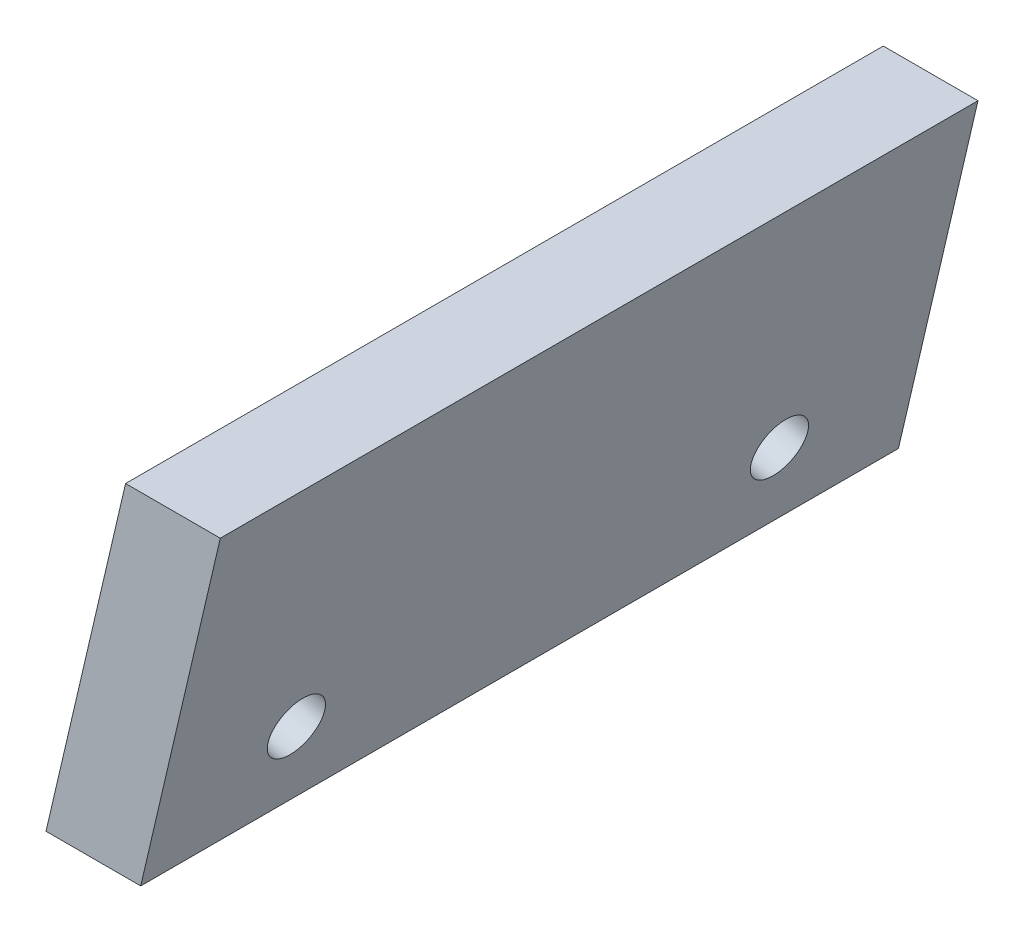
ISO-10303-21;
HEADER;
FILE_DESCRIPTION(('STEP AP214'),'2;1');
FILE_NAME('part.step','',(''),(''),'','','');
FILE_SCHEMA(('AUTOMOTIVE_DESIGN { 1 0 10303 214 1 1 1 1 }'));
ENDSEC;
DATA;
#1=APPLICATION_CONTEXT('core data for automotive mechanical design processes');
#2=APPLICATION_PROTOCOL_DEFINITION('international standard','automotive_design',2000,#1);
#3=PRODUCT_CONTEXT('',#1,'mechanical');
#4=PRODUCT('Part','Part','',(#3));
#5=PRODUCT_RELATED_PRODUCT_CATEGORY('part','',(#4));
#6=PRODUCT_DEFINITION_FORMATION('','',#4);
#7=PRODUCT_DEFINITION_CONTEXT('part definition',#1,'design');
#8=PRODUCT_DEFINITION('design','',#6,#7);
#9=PRODUCT_DEFINITION_SHAPE('','',#8);
#10=(LENGTH_UNIT() NAMED_UNIT(*) SI_UNIT(.MILLI.,.METRE.));
#11=(NAMED_UNIT(*) PLANE_ANGLE_UNIT() SI_UNIT($,.RADIAN.));
#12=(NAMED_UNIT(*) SI_UNIT($,.STERADIAN.) SOLID_ANGLE_UNIT());
#13=UNCERTAINTY_MEASURE_WITH_UNIT(LENGTH_MEASURE(1.E-05),#10,'distance_accuracy_value','');
#14=(GEOMETRIC_REPRESENTATION_CONTEXT(3) GLOBAL_UNCERTAINTY_ASSIGNED_CONTEXT((#13)) GLOBAL_UNIT_ASSIGNED_CONTEXT((#10,
#11,#12)) REPRESENTATION_CONTEXT('',''));
#15=CARTESIAN_POINT('',(0.,0.,0.));
#16=DIRECTION('',(0.,0.,1.));
#17=DIRECTION('',(1.,0.,0.));
#18=AXIS2_PLACEMENT_3D('',#15,#16,#17);
#19=CARTESIAN_POINT('',(0.,0.,20.));
#20=DIRECTION('',(0.97383605158167,-0.227251720873184,0.));
#21=DIRECTION('',(0.227251720873184,0.97383605158167,0.));
#22=AXIS2_PLACEMENT_3D('',#19,#20,#21);
#23=PLANE('',#22);
#24=CARTESIAN_POINT('',(0.613579646357596,2.62935733927051,3.625));
#25=DIRECTION('',(-0.97383605158167,0.227251720873184,0.));
#26=DIRECTION('',(-0.227251720873184,-0.97383605158167,0.));
#27=AXIS2_PLACEMENT_3D('',#24,#25,#26);
#28=CIRCLE('',#27,0.75);
#29=CARTESIAN_POINT('',(0.443140855702708,1.89898030058426,3.625));
#30=VERTEX_POINT('',#29);
#31=EDGE_CURVE('E108',#30,#30,#28,.T.);
#32=ORIENTED_EDGE('',*,*,#31,.F.);
#33=EDGE_LOOP('',(#32));
#34=FACE_BOUND('',#33,.T.);
#35=CARTESIAN_POINT('',(0.613579646357596,2.62935733927051,16.375));
#36=DIRECTION('',(-0.97383605158167,0.227251720873184,0.));
#37=DIRECTION('',(-0.227251720873184,-0.97383605158167,0.));
#38=AXIS2_PLACEMENT_3D('',#35,#36,#37);
#39=CIRCLE('',#38,0.750000000000002);
#40=CARTESIAN_POINT('',(0.443140855702708,1.89898030058425,16.375));
#41=VERTEX_POINT('',#40);
#42=EDGE_CURVE('E113',#41,#41,#39,.T.);
#43=ORIENTED_EDGE('',*,*,#42,.F.);
#44=EDGE_LOOP('',(#43));
#45=FACE_BOUND('',#44,.T.);
#46=DIRECTION('',(-0.227251720873184,-0.97383605158167,0.));
#47=VECTOR('',#46,1.);
#48=CARTESIAN_POINT('',(0.,0.,0.));
#49=LINE('',#48,#47);
#50=CARTESIAN_POINT('',(2.1002154156614,9.,0.));
#51=VERTEX_POINT('',#50);
#52=CARTESIAN_POINT('',(0.,0.,0.));
#53=VERTEX_POINT('',#52);
#54=EDGE_CURVE('E99',#51,#53,#49,.T.);
#55=ORIENTED_EDGE('',*,*,#54,.T.);
#56=DIRECTION('',(0.,0.,-1.));
#57=VECTOR('',#56,1.);
#58=CARTESIAN_POINT('',(0.,0.,20.));
#59=LINE('',#58,#57);
#60=CARTESIAN_POINT('',(0.,0.,20.));
#61=VERTEX_POINT('',#60);
#62=EDGE_CURVE('E11',#61,#53,#59,.T.);
#63=ORIENTED_EDGE('',*,*,#62,.F.);
#64=DIRECTION('',(-0.227251720873184,-0.97383605158167,0.));
#65=VECTOR('',#64,1.);
#66=CARTESIAN_POINT('',(0.,0.,20.));
#67=LINE('',#66,#65);
#68=CARTESIAN_POINT('',(2.1002154156614,9.,20.));
#69=VERTEX_POINT('',#68);
#70=EDGE_CURVE('E86',#69,#61,#67,.T.);
#71=ORIENTED_EDGE('',*,*,#70,.F.);
#72=DIRECTION('',(0.,0.,-1.));
#73=VECTOR('',#72,1.);
#74=CARTESIAN_POINT('',(2.1002154156614,9.,20.));
#75=LINE('',#74,#73);
#76=EDGE_CURVE('E95',#69,#51,#75,.T.);
#77=ORIENTED_EDGE('',*,*,#76,.T.);
#78=EDGE_LOOP('',(#55,#63,#71,#77));
#79=FACE_BOUND('',#78,.T.);
#80=ADVANCED_FACE('F33',(#34,#45,#79),#23,.F.);
#81=CARTESIAN_POINT('',(0.,0.,20.));
#82=DIRECTION('',(0.,1.,0.));
#83=DIRECTION('',(0.,0.,1.));
#84=AXIS2_PLACEMENT_3D('',#81,#82,#83);
#85=PLANE('',#84);
#86=DIRECTION('',(1.,0.,0.));
#87=VECTOR('',#86,1.);
#88=CARTESIAN_POINT('',(0.,0.,0.));
#89=LINE('',#88,#87);
#90=CARTESIAN_POINT('',(2.5,0.,0.));
#91=VERTEX_POINT('',#90);
#92=EDGE_CURVE('E90',#53,#91,#89,.T.);
#93=ORIENTED_EDGE('',*,*,#92,.T.);
#94=DIRECTION('',(0.,0.,-1.));
#95=VECTOR('',#94,1.);
#96=CARTESIAN_POINT('',(2.5,0.,20.));
#97=LINE('',#96,#95);
#98=CARTESIAN_POINT('',(2.5,0.,20.));
#99=VERTEX_POINT('',#98);
#100=EDGE_CURVE('E42',#99,#91,#97,.T.);
#101=ORIENTED_EDGE('',*,*,#100,.F.);
#102=DIRECTION('',(1.,0.,0.));
#103=VECTOR('',#102,1.);
#104=CARTESIAN_POINT('',(0.,0.,20.));
#105=LINE('',#104,#103);
#106=EDGE_CURVE('E81',#61,#99,#105,.T.);
#107=ORIENTED_EDGE('',*,*,#106,.F.);
#108=ORIENTED_EDGE('',*,*,#62,.T.);
#109=EDGE_LOOP('',(#93,#101,#107,#108));
#110=FACE_BOUND('',#109,.T.);
#111=ADVANCED_FACE('F89',(#110),#85,.F.);
#112=CARTESIAN_POINT('',(2.5,0.,20.));
#113=DIRECTION('',(-0.97383605158167,0.227251720873184,0.));
#114=DIRECTION('',(-0.227251720873184,-0.97383605158167,0.));
#115=AXIS2_PLACEMENT_3D('',#112,#113,#114);
#116=PLANE('',#115);
#117=CARTESIAN_POINT('',(2.98447128475804,2.07609254284481,3.625));
#118=DIRECTION('',(-0.97383605158167,0.227251720873184,0.));
#119=DIRECTION('',(-0.227251720873184,-0.97383605158167,0.));
#120=AXIS2_PLACEMENT_3D('',#117,#118,#119);
#121=CIRCLE('',#120,0.75);
#122=CARTESIAN_POINT('',(2.81403249410315,1.34571550415855,3.625));
#123=VERTEX_POINT('',#122);
#124=EDGE_CURVE('E36',#123,#123,#121,.T.);
#125=ORIENTED_EDGE('',*,*,#124,.T.);
#126=EDGE_LOOP('',(#125));
#127=FACE_BOUND('',#126,.T.);
#128=CARTESIAN_POINT('',(2.98447128475804,2.07609254284481,16.375));
#129=DIRECTION('',(-0.97383605158167,0.227251720873184,0.));
#130=DIRECTION('',(-0.227251720873184,-0.97383605158167,0.));
#131=AXIS2_PLACEMENT_3D('',#128,#129,#130);
#132=CIRCLE('',#131,0.750000000000002);
#133=CARTESIAN_POINT('',(2.81403249410315,1.34571550415855,16.375));
#134=VERTEX_POINT('',#133);
#135=EDGE_CURVE('E106',#134,#134,#132,.T.);
#136=ORIENTED_EDGE('',*,*,#135,.T.);
#137=EDGE_LOOP('',(#136));
#138=FACE_BOUND('',#137,.T.);
#139=DIRECTION('',(0.227251720873184,0.97383605158167,0.));
#140=VECTOR('',#139,1.);
#141=CARTESIAN_POINT('',(2.5,0.,0.));
#142=LINE('',#141,#140);
#143=CARTESIAN_POINT('',(4.6002154156614,9.,0.));
#144=VERTEX_POINT('',#143);
#145=EDGE_CURVE('E68',#91,#144,#142,.T.);
#146=ORIENTED_EDGE('',*,*,#145,.T.);
#147=DIRECTION('',(0.,0.,-1.));
#148=VECTOR('',#147,1.);
#149=CARTESIAN_POINT('',(4.6002154156614,9.,20.));
#150=LINE('',#149,#148);
#151=CARTESIAN_POINT('',(4.6002154156614,9.,20.));
#152=VERTEX_POINT('',#151);
#153=EDGE_CURVE('E91',#152,#144,#150,.T.);
#154=ORIENTED_EDGE('',*,*,#153,.F.);
#155=DIRECTION('',(0.227251720873184,0.97383605158167,0.));
#156=VECTOR('',#155,1.);
#157=CARTESIAN_POINT('',(2.5,0.,20.));
#158=LINE('',#157,#156);
#159=EDGE_CURVE('E84',#99,#152,#158,.T.);
#160=ORIENTED_EDGE('',*,*,#159,.F.);
#161=ORIENTED_EDGE('',*,*,#100,.T.);
#162=EDGE_LOOP('',(#146,#154,#160,#161));
#163=FACE_BOUND('',#162,.T.);
#164=ADVANCED_FACE('F93',(#127,#138,#163),#116,.F.);
#165=CARTESIAN_POINT('',(4.6002154156614,9.,20.));
#166=DIRECTION('',(0.,-1.,0.));
#167=DIRECTION('',(0.,0.,-1.));
#168=AXIS2_PLACEMENT_3D('',#165,#166,#167);
#169=PLANE('',#168);
#170=DIRECTION('',(-1.,0.,0.));
#171=VECTOR('',#170,1.);
#172=CARTESIAN_POINT('',(4.6002154156614,9.,0.));
#173=LINE('',#172,#171);
#174=EDGE_CURVE('E74',#144,#51,#173,.T.);
#175=ORIENTED_EDGE('',*,*,#174,.T.);
#176=ORIENTED_EDGE('',*,*,#76,.F.);
#177=DIRECTION('',(-1.,0.,0.));
#178=VECTOR('',#177,1.);
#179=CARTESIAN_POINT('',(4.6002154156614,9.,20.));
#180=LINE('',#179,#178);
#181=EDGE_CURVE('E51',#152,#69,#180,.T.);
#182=ORIENTED_EDGE('',*,*,#181,.F.);
#183=ORIENTED_EDGE('',*,*,#153,.T.);
#184=EDGE_LOOP('',(#175,#176,#182,#183));
#185=FACE_BOUND('',#184,.T.);
#186=ADVANCED_FACE('F138',(#185),#169,.F.);
#187=CARTESIAN_POINT('',(0.,0.,20.));
#188=DIRECTION('',(0.,0.,1.));
#189=DIRECTION('',(1.,0.,0.));
#190=AXIS2_PLACEMENT_3D('',#187,#188,#189);
#191=PLANE('',#190);
#192=ORIENTED_EDGE('',*,*,#70,.T.);
#193=ORIENTED_EDGE('',*,*,#106,.T.);
#194=ORIENTED_EDGE('',*,*,#159,.T.);
#195=ORIENTED_EDGE('',*,*,#181,.T.);
#196=EDGE_LOOP('',(#192,#193,#194,#195));
#197=FACE_BOUND('',#196,.T.);
#198=ADVANCED_FACE('F82',(#197),#191,.T.);
#199=CARTESIAN_POINT('',(0.,0.,0.));
#200=DIRECTION('',(0.,0.,1.));
#201=DIRECTION('',(1.,0.,0.));
#202=AXIS2_PLACEMENT_3D('',#199,#200,#201);
#203=PLANE('',#202);
#204=ORIENTED_EDGE('',*,*,#54,.F.);
#205=ORIENTED_EDGE('',*,*,#174,.F.);
#206=ORIENTED_EDGE('',*,*,#145,.F.);
#207=ORIENTED_EDGE('',*,*,#92,.F.);
#208=EDGE_LOOP('',(#204,#205,#206,#207));
#209=FACE_BOUND('',#208,.T.);
#210=ADVANCED_FACE('F129',(#209),#203,.F.);
#211=CARTESIAN_POINT('',(4.97622455189057,1.6113024410864,16.375));
#212=DIRECTION('',(-0.97383605158167,0.227251720873184,0.));
#213=DIRECTION('',(-0.227251720873184,-0.97383605158167,0.));
#214=AXIS2_PLACEMENT_3D('',#211,#212,#213);
#215=CYLINDRICAL_SURFACE('',#214,0.750000000000002);
#216=ORIENTED_EDGE('',*,*,#42,.T.);
#217=EDGE_LOOP('',(#216));
#218=FACE_BOUND('',#217,.T.);
#219=ORIENTED_EDGE('',*,*,#135,.F.);
#220=EDGE_LOOP('',(#219));
#221=FACE_BOUND('',#220,.T.);
#222=ADVANCED_FACE('F121',(#218,#221),#215,.F.);
#223=CARTESIAN_POINT('',(4.97622455189057,1.6113024410864,3.625));
#224=DIRECTION('',(-0.97383605158167,0.227251720873184,0.));
#225=DIRECTION('',(-0.227251720873184,-0.97383605158167,0.));
#226=AXIS2_PLACEMENT_3D('',#223,#224,#225);
#227=CYLINDRICAL_SURFACE('',#226,0.75);
#228=ORIENTED_EDGE('',*,*,#31,.T.);
#229=EDGE_LOOP('',(#228));
#230=FACE_BOUND('',#229,.T.);
#231=ORIENTED_EDGE('',*,*,#124,.F.);
#232=EDGE_LOOP('',(#231));
#233=FACE_BOUND('',#232,.T.);
#234=ADVANCED_FACE('F136',(#230,#233),#227,.F.);
#235=CLOSED_SHELL('',(#80,#111,#164,#186,#198,#210,#222,#234));
#236=MANIFOLD_SOLID_BREP('B2',#235);
#237=ADVANCED_BREP_SHAPE_REPRESENTATION('',(#18,#236),#14);
#238=SHAPE_DEFINITION_REPRESENTATION(#9,#237);
ENDSEC;
END-ISO-10303-21;
